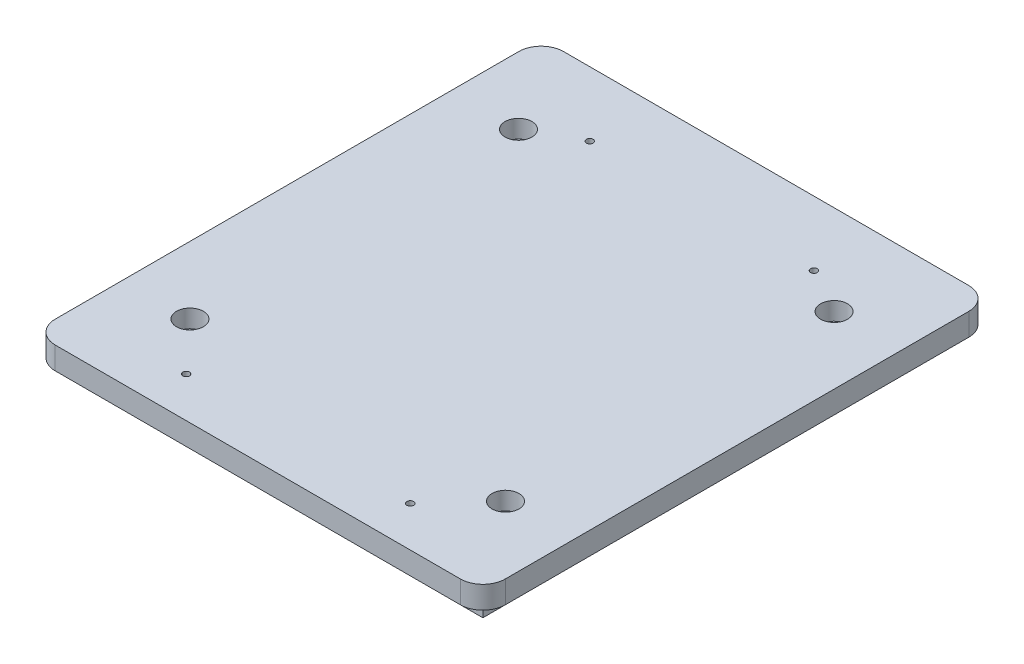
ISO-10303-21;
HEADER;
FILE_DESCRIPTION(('STEP AP214'),'2;1');
FILE_NAME('part.step','',(''),(''),'','','');
FILE_SCHEMA(('AUTOMOTIVE_DESIGN { 1 0 10303 214 1 1 1 1 }'));
ENDSEC;
DATA;
#1=APPLICATION_CONTEXT('core data for automotive mechanical design processes');
#2=APPLICATION_PROTOCOL_DEFINITION('international standard','automotive_design',2000,#1);
#3=PRODUCT_CONTEXT('',#1,'mechanical');
#4=PRODUCT('Part','Part','',(#3));
#5=PRODUCT_RELATED_PRODUCT_CATEGORY('part','',(#4));
#6=PRODUCT_DEFINITION_FORMATION('','',#4);
#7=PRODUCT_DEFINITION_CONTEXT('part definition',#1,'design');
#8=PRODUCT_DEFINITION('design','',#6,#7);
#9=PRODUCT_DEFINITION_SHAPE('','',#8);
#10=(LENGTH_UNIT() NAMED_UNIT(*) SI_UNIT(.MILLI.,.METRE.));
#11=(NAMED_UNIT(*) PLANE_ANGLE_UNIT() SI_UNIT($,.RADIAN.));
#12=(NAMED_UNIT(*) SI_UNIT($,.STERADIAN.) SOLID_ANGLE_UNIT());
#13=UNCERTAINTY_MEASURE_WITH_UNIT(LENGTH_MEASURE(1.E-05),#10,'distance_accuracy_value','');
#14=(GEOMETRIC_REPRESENTATION_CONTEXT(3) GLOBAL_UNCERTAINTY_ASSIGNED_CONTEXT((#13)) GLOBAL_UNIT_ASSIGNED_CONTEXT((#10,
#11,#12)) REPRESENTATION_CONTEXT('',''));
#15=CARTESIAN_POINT('',(0.,0.,0.));
#16=DIRECTION('',(0.,0.,1.));
#17=DIRECTION('',(1.,0.,0.));
#18=AXIS2_PLACEMENT_3D('',#15,#16,#17);
#19=CARTESIAN_POINT('',(-35.2,-12.,-36.65));
#20=DIRECTION('',(0.,1.,0.));
#21=DIRECTION('',(0.,0.,1.));
#22=AXIS2_PLACEMENT_3D('',#19,#20,#21);
#23=CYLINDRICAL_SURFACE('',#22,1.5);
#24=CARTESIAN_POINT('',(-35.2,-5.,-36.65));
#25=DIRECTION('',(0.,1.,0.));
#26=DIRECTION('',(0.,0.,1.));
#27=AXIS2_PLACEMENT_3D('',#24,#25,#26);
#28=CIRCLE('',#27,1.5);
#29=CARTESIAN_POINT('',(-35.2,-5.,-35.15));
#30=VERTEX_POINT('',#29);
#31=EDGE_CURVE('E208',#30,#30,#28,.T.);
#32=ORIENTED_EDGE('',*,*,#31,.F.);
#33=EDGE_LOOP('',(#32));
#34=FACE_BOUND('',#33,.T.);
#35=CARTESIAN_POINT('',(-35.2,1.,-36.65));
#36=DIRECTION('',(0.,1.,0.));
#37=DIRECTION('',(0.,0.,1.));
#38=AXIS2_PLACEMENT_3D('',#35,#36,#37);
#39=CIRCLE('',#38,1.5);
#40=CARTESIAN_POINT('',(-35.2,1.,-35.15));
#41=VERTEX_POINT('',#40);
#42=EDGE_CURVE('E212',#41,#41,#39,.F.);
#43=ORIENTED_EDGE('',*,*,#42,.F.);
#44=EDGE_LOOP('',(#43));
#45=FACE_BOUND('',#44,.T.);
#46=ADVANCED_FACE('F34',(#34,#45),#23,.F.);
#47=CARTESIAN_POINT('',(35.2,-12.,36.65));
#48=DIRECTION('',(0.,1.,0.));
#49=DIRECTION('',(0.,0.,1.));
#50=AXIS2_PLACEMENT_3D('',#47,#48,#49);
#51=CYLINDRICAL_SURFACE('',#50,1.5);
#52=CARTESIAN_POINT('',(35.2,-5.,36.65));
#53=DIRECTION('',(0.,1.,0.));
#54=DIRECTION('',(0.,0.,1.));
#55=AXIS2_PLACEMENT_3D('',#52,#53,#54);
#56=CIRCLE('',#55,1.5);
#57=CARTESIAN_POINT('',(35.2,-5.,38.15));
#58=VERTEX_POINT('',#57);
#59=EDGE_CURVE('E211',#58,#58,#56,.T.);
#60=ORIENTED_EDGE('',*,*,#59,.F.);
#61=EDGE_LOOP('',(#60));
#62=FACE_BOUND('',#61,.T.);
#63=CARTESIAN_POINT('',(35.2,1.,36.65));
#64=DIRECTION('',(0.,1.,0.));
#65=DIRECTION('',(0.,0.,1.));
#66=AXIS2_PLACEMENT_3D('',#63,#64,#65);
#67=CIRCLE('',#66,1.5);
#68=CARTESIAN_POINT('',(35.2,1.,38.15));
#69=VERTEX_POINT('',#68);
#70=EDGE_CURVE('E228',#69,#69,#67,.F.);
#71=ORIENTED_EDGE('',*,*,#70,.F.);
#72=EDGE_LOOP('',(#71));
#73=FACE_BOUND('',#72,.T.);
#74=ADVANCED_FACE('F338',(#62,#73),#51,.F.);
#75=CARTESIAN_POINT('',(35.2,-12.,-36.65));
#76=DIRECTION('',(0.,1.,0.));
#77=DIRECTION('',(0.,0.,1.));
#78=AXIS2_PLACEMENT_3D('',#75,#76,#77);
#79=CYLINDRICAL_SURFACE('',#78,1.5);
#80=CARTESIAN_POINT('',(35.2,-5.,-36.65));
#81=DIRECTION('',(0.,1.,0.));
#82=DIRECTION('',(0.,0.,1.));
#83=AXIS2_PLACEMENT_3D('',#80,#81,#82);
#84=CIRCLE('',#83,1.5);
#85=CARTESIAN_POINT('',(35.2,-5.,-35.15));
#86=VERTEX_POINT('',#85);
#87=EDGE_CURVE('E215',#86,#86,#84,.T.);
#88=ORIENTED_EDGE('',*,*,#87,.F.);
#89=EDGE_LOOP('',(#88));
#90=FACE_BOUND('',#89,.T.);
#91=CARTESIAN_POINT('',(35.2,1.,-36.65));
#92=DIRECTION('',(0.,1.,0.));
#93=DIRECTION('',(0.,0.,1.));
#94=AXIS2_PLACEMENT_3D('',#91,#92,#93);
#95=CIRCLE('',#94,1.5);
#96=CARTESIAN_POINT('',(35.2,1.,-35.15));
#97=VERTEX_POINT('',#96);
#98=EDGE_CURVE('E224',#97,#97,#95,.F.);
#99=ORIENTED_EDGE('',*,*,#98,.F.);
#100=EDGE_LOOP('',(#99));
#101=FACE_BOUND('',#100,.T.);
#102=ADVANCED_FACE('F345',(#90,#101),#79,.F.);
#103=CARTESIAN_POINT('',(-35.2,-12.,36.65));
#104=DIRECTION('',(0.,1.,0.));
#105=DIRECTION('',(0.,0.,1.));
#106=AXIS2_PLACEMENT_3D('',#103,#104,#105);
#107=CYLINDRICAL_SURFACE('',#106,1.5);
#108=CARTESIAN_POINT('',(-35.2,-5.,36.65));
#109=DIRECTION('',(0.,1.,0.));
#110=DIRECTION('',(0.,0.,1.));
#111=AXIS2_PLACEMENT_3D('',#108,#109,#110);
#112=CIRCLE('',#111,1.5);
#113=CARTESIAN_POINT('',(-35.2,-5.,38.15));
#114=VERTEX_POINT('',#113);
#115=EDGE_CURVE('E218',#114,#114,#112,.T.);
#116=ORIENTED_EDGE('',*,*,#115,.F.);
#117=EDGE_LOOP('',(#116));
#118=FACE_BOUND('',#117,.T.);
#119=CARTESIAN_POINT('',(-35.2,1.,36.65));
#120=DIRECTION('',(0.,1.,0.));
#121=DIRECTION('',(0.,0.,1.));
#122=AXIS2_PLACEMENT_3D('',#119,#120,#121);
#123=CIRCLE('',#122,1.5);
#124=CARTESIAN_POINT('',(-35.2,1.,38.15));
#125=VERTEX_POINT('',#124);
#126=EDGE_CURVE('E221',#125,#125,#123,.F.);
#127=ORIENTED_EDGE('',*,*,#126,.F.);
#128=EDGE_LOOP('',(#127));
#129=FACE_BOUND('',#128,.T.);
#130=ADVANCED_FACE('F370',(#118,#129),#107,.F.);
#131=CARTESIAN_POINT('',(50.2,5.,56.7));
#132=DIRECTION('',(-1.,0.,0.));
#133=DIRECTION('',(0.,0.,1.));
#134=AXIS2_PLACEMENT_3D('',#131,#132,#133);
#135=PLANE('',#134);
#136=DIRECTION('',(0.,0.,-1.));
#137=VECTOR('',#136,1.);
#138=CARTESIAN_POINT('',(50.2,0.,56.7));
#139=LINE('',#138,#137);
#140=CARTESIAN_POINT('',(50.2,0.,51.7));
#141=VERTEX_POINT('',#140);
#142=CARTESIAN_POINT('',(50.2,0.,-51.7));
#143=VERTEX_POINT('',#142);
#144=EDGE_CURVE('E150',#141,#143,#139,.T.);
#145=ORIENTED_EDGE('',*,*,#144,.T.);
#146=DIRECTION('',(0.,-1.,0.));
#147=VECTOR('',#146,1.);
#148=CARTESIAN_POINT('',(50.2,5.,-51.7));
#149=LINE('',#148,#147);
#150=CARTESIAN_POINT('',(50.2,5.,-51.7));
#151=VERTEX_POINT('',#150);
#152=EDGE_CURVE('E204',#143,#151,#149,.F.);
#153=ORIENTED_EDGE('',*,*,#152,.T.);
#154=DIRECTION('',(0.,0.,-1.));
#155=VECTOR('',#154,1.);
#156=CARTESIAN_POINT('',(50.2,5.,56.7));
#157=LINE('',#156,#155);
#158=CARTESIAN_POINT('',(50.2,5.,51.7));
#159=VERTEX_POINT('',#158);
#160=EDGE_CURVE('E159',#159,#151,#157,.T.);
#161=ORIENTED_EDGE('',*,*,#160,.F.);
#162=DIRECTION('',(0.,-1.,0.));
#163=VECTOR('',#162,1.);
#164=CARTESIAN_POINT('',(50.2,5.,51.7));
#165=LINE('',#164,#163);
#166=EDGE_CURVE('E201',#159,#141,#165,.T.);
#167=ORIENTED_EDGE('',*,*,#166,.T.);
#168=EDGE_LOOP('',(#145,#153,#161,#167));
#169=FACE_BOUND('',#168,.T.);
#170=ADVANCED_FACE('F314',(#169),#135,.F.);
#171=CARTESIAN_POINT('',(-50.2,5.,-56.7));
#172=DIRECTION('',(0.,0.,1.));
#173=DIRECTION('',(1.,0.,0.));
#174=AXIS2_PLACEMENT_3D('',#171,#172,#173);
#175=PLANE('',#174);
#176=DIRECTION('',(-1.,0.,0.));
#177=VECTOR('',#176,1.);
#178=CARTESIAN_POINT('',(-50.2,0.,-56.7));
#179=LINE('',#178,#177);
#180=CARTESIAN_POINT('',(45.2,0.,-56.7));
#181=VERTEX_POINT('',#180);
#182=CARTESIAN_POINT('',(-45.2,0.,-56.7));
#183=VERTEX_POINT('',#182);
#184=EDGE_CURVE('E153',#181,#183,#179,.T.);
#185=ORIENTED_EDGE('',*,*,#184,.T.);
#186=DIRECTION('',(0.,-1.,0.));
#187=VECTOR('',#186,1.);
#188=CARTESIAN_POINT('',(-45.2,5.,-56.7));
#189=LINE('',#188,#187);
#190=CARTESIAN_POINT('',(-45.2,5.,-56.7));
#191=VERTEX_POINT('',#190);
#192=EDGE_CURVE('E192',#183,#191,#189,.F.);
#193=ORIENTED_EDGE('',*,*,#192,.T.);
#194=DIRECTION('',(-1.,0.,0.));
#195=VECTOR('',#194,1.);
#196=CARTESIAN_POINT('',(-50.2,5.,-56.7));
#197=LINE('',#196,#195);
#198=CARTESIAN_POINT('',(45.2,5.,-56.7));
#199=VERTEX_POINT('',#198);
#200=EDGE_CURVE('E162',#199,#191,#197,.T.);
#201=ORIENTED_EDGE('',*,*,#200,.F.);
#202=DIRECTION('',(0.,-1.,0.));
#203=VECTOR('',#202,1.);
#204=CARTESIAN_POINT('',(45.2,5.,-56.7));
#205=LINE('',#204,#203);
#206=EDGE_CURVE('E189',#199,#181,#205,.T.);
#207=ORIENTED_EDGE('',*,*,#206,.T.);
#208=EDGE_LOOP('',(#185,#193,#201,#207));
#209=FACE_BOUND('',#208,.T.);
#210=ADVANCED_FACE('F322',(#209),#175,.F.);
#211=CARTESIAN_POINT('',(-50.2,5.,56.7));
#212=DIRECTION('',(1.,0.,0.));
#213=DIRECTION('',(0.,0.,-1.));
#214=AXIS2_PLACEMENT_3D('',#211,#212,#213);
#215=PLANE('',#214);
#216=DIRECTION('',(0.,0.,1.));
#217=VECTOR('',#216,1.);
#218=CARTESIAN_POINT('',(-50.2,5.,56.7));
#219=LINE('',#218,#217);
#220=CARTESIAN_POINT('',(-50.2,5.,-51.7));
#221=VERTEX_POINT('',#220);
#222=CARTESIAN_POINT('',(-50.2,5.,51.7));
#223=VERTEX_POINT('',#222);
#224=EDGE_CURVE('E166',#221,#223,#219,.T.);
#225=ORIENTED_EDGE('',*,*,#224,.F.);
#226=DIRECTION('',(0.,-1.,0.));
#227=VECTOR('',#226,1.);
#228=CARTESIAN_POINT('',(-50.2,5.,-51.7));
#229=LINE('',#228,#227);
#230=CARTESIAN_POINT('',(-50.2,0.,-51.7));
#231=VERTEX_POINT('',#230);
#232=EDGE_CURVE('E178',#221,#231,#229,.T.);
#233=ORIENTED_EDGE('',*,*,#232,.T.);
#234=DIRECTION('',(0.,0.,1.));
#235=VECTOR('',#234,1.);
#236=CARTESIAN_POINT('',(-50.2,0.,56.7));
#237=LINE('',#236,#235);
#238=CARTESIAN_POINT('',(-50.2,0.,51.7));
#239=VERTEX_POINT('',#238);
#240=EDGE_CURVE('E173',#231,#239,#237,.T.);
#241=ORIENTED_EDGE('',*,*,#240,.T.);
#242=DIRECTION('',(0.,-1.,0.));
#243=VECTOR('',#242,1.);
#244=CARTESIAN_POINT('',(-50.2,5.,51.7));
#245=LINE('',#244,#243);
#246=EDGE_CURVE('E169',#239,#223,#245,.F.);
#247=ORIENTED_EDGE('',*,*,#246,.T.);
#248=EDGE_LOOP('',(#225,#233,#241,#247));
#249=FACE_BOUND('',#248,.T.);
#250=ADVANCED_FACE('F302',(#249),#215,.F.);
#251=CARTESIAN_POINT('',(-50.2,5.,56.7));
#252=DIRECTION('',(0.,0.,-1.));
#253=DIRECTION('',(-1.,0.,0.));
#254=AXIS2_PLACEMENT_3D('',#251,#252,#253);
#255=PLANE('',#254);
#256=DIRECTION('',(1.,0.,0.));
#257=VECTOR('',#256,1.);
#258=CARTESIAN_POINT('',(-50.2,0.,56.7));
#259=LINE('',#258,#257);
#260=CARTESIAN_POINT('',(-45.2,0.,56.7));
#261=VERTEX_POINT('',#260);
#262=CARTESIAN_POINT('',(45.2,0.,56.7));
#263=VERTEX_POINT('',#262);
#264=EDGE_CURVE('E163',#261,#263,#259,.T.);
#265=ORIENTED_EDGE('',*,*,#264,.T.);
#266=DIRECTION('',(0.,-1.,0.));
#267=VECTOR('',#266,1.);
#268=CARTESIAN_POINT('',(45.2,5.,56.7));
#269=LINE('',#268,#267);
#270=CARTESIAN_POINT('',(45.2,5.,56.7));
#271=VERTEX_POINT('',#270);
#272=EDGE_CURVE('E11',#263,#271,#269,.F.);
#273=ORIENTED_EDGE('',*,*,#272,.T.);
#274=DIRECTION('',(1.,0.,0.));
#275=VECTOR('',#274,1.);
#276=CARTESIAN_POINT('',(-50.2,5.,56.7));
#277=LINE('',#276,#275);
#278=CARTESIAN_POINT('',(-45.2,5.,56.7));
#279=VERTEX_POINT('',#278);
#280=EDGE_CURVE('E168',#279,#271,#277,.T.);
#281=ORIENTED_EDGE('',*,*,#280,.F.);
#282=DIRECTION('',(0.,-1.,0.));
#283=VECTOR('',#282,1.);
#284=CARTESIAN_POINT('',(-45.2,5.,56.7));
#285=LINE('',#284,#283);
#286=EDGE_CURVE('E43',#279,#261,#285,.T.);
#287=ORIENTED_EDGE('',*,*,#286,.T.);
#288=EDGE_LOOP('',(#265,#273,#281,#287));
#289=FACE_BOUND('',#288,.T.);
#290=ADVANCED_FACE('F306',(#289),#255,.F.);
#291=CARTESIAN_POINT('',(0.,5.,0.));
#292=DIRECTION('',(0.,-1.,0.));
#293=DIRECTION('',(0.,0.,-1.));
#294=AXIS2_PLACEMENT_3D('',#291,#292,#293);
#295=PLANE('',#294);
#296=CARTESIAN_POINT('',(-25.,5.,47.7));
#297=DIRECTION('',(0.,1.,0.));
#298=DIRECTION('',(0.,0.,1.));
#299=AXIS2_PLACEMENT_3D('',#296,#297,#298);
#300=CIRCLE('',#299,0.750000000000002);
#301=CARTESIAN_POINT('',(-25.,5.,48.45));
#302=VERTEX_POINT('',#301);
#303=EDGE_CURVE('E456',#302,#302,#300,.T.);
#304=ORIENTED_EDGE('',*,*,#303,.F.);
#305=EDGE_LOOP('',(#304));
#306=FACE_BOUND('',#305,.T.);
#307=CARTESIAN_POINT('',(25.054333875246,5.,-42.2999835990541));
#308=DIRECTION('',(0.,1.,0.));
#309=DIRECTION('',(0.,0.,1.));
#310=AXIS2_PLACEMENT_3D('',#307,#308,#309);
#311=CIRCLE('',#310,0.750000000002579);
#312=CARTESIAN_POINT('',(25.054333875246,5.,-41.5499835990515));
#313=VERTEX_POINT('',#312);
#314=EDGE_CURVE('E453',#313,#313,#311,.T.);
#315=ORIENTED_EDGE('',*,*,#314,.F.);
#316=EDGE_LOOP('',(#315));
#317=FACE_BOUND('',#316,.T.);
#318=CARTESIAN_POINT('',(25.,5.,47.7));
#319=DIRECTION('',(0.,1.,0.));
#320=DIRECTION('',(0.,0.,1.));
#321=AXIS2_PLACEMENT_3D('',#318,#319,#320);
#322=CIRCLE('',#321,0.750000000000002);
#323=CARTESIAN_POINT('',(25.,5.,48.45));
#324=VERTEX_POINT('',#323);
#325=EDGE_CURVE('E434',#324,#324,#322,.T.);
#326=ORIENTED_EDGE('',*,*,#325,.F.);
#327=EDGE_LOOP('',(#326));
#328=FACE_BOUND('',#327,.T.);
#329=CARTESIAN_POINT('',(-24.945666124754,5.,-42.2999835990541));
#330=DIRECTION('',(0.,1.,0.));
#331=DIRECTION('',(0.,0.,1.));
#332=AXIS2_PLACEMENT_3D('',#329,#330,#331);
#333=CIRCLE('',#332,0.750000000000002);
#334=CARTESIAN_POINT('',(-24.945666124754,5.,-41.5499835990541));
#335=VERTEX_POINT('',#334);
#336=EDGE_CURVE('E237',#335,#335,#333,.T.);
#337=ORIENTED_EDGE('',*,*,#336,.F.);
#338=EDGE_LOOP('',(#337));
#339=FACE_BOUND('',#338,.T.);
#340=CARTESIAN_POINT('',(-35.2,5.,36.65));
#341=DIRECTION('',(0.,1.,0.));
#342=DIRECTION('',(0.,0.,1.));
#343=AXIS2_PLACEMENT_3D('',#340,#341,#342);
#344=CIRCLE('',#343,3.);
#345=CARTESIAN_POINT('',(-35.2,5.,39.65));
#346=VERTEX_POINT('',#345);
#347=EDGE_CURVE('E261',#346,#346,#344,.T.);
#348=ORIENTED_EDGE('',*,*,#347,.F.);
#349=EDGE_LOOP('',(#348));
#350=FACE_BOUND('',#349,.T.);
#351=CARTESIAN_POINT('',(35.2,5.,-36.65));
#352=DIRECTION('',(0.,1.,0.));
#353=DIRECTION('',(0.,0.,1.));
#354=AXIS2_PLACEMENT_3D('',#351,#352,#353);
#355=CIRCLE('',#354,3.);
#356=CARTESIAN_POINT('',(35.2,5.,-33.65));
#357=VERTEX_POINT('',#356);
#358=EDGE_CURVE('E253',#357,#357,#355,.T.);
#359=ORIENTED_EDGE('',*,*,#358,.F.);
#360=EDGE_LOOP('',(#359));
#361=FACE_BOUND('',#360,.T.);
#362=CARTESIAN_POINT('',(35.2,5.,36.65));
#363=DIRECTION('',(0.,1.,0.));
#364=DIRECTION('',(0.,0.,1.));
#365=AXIS2_PLACEMENT_3D('',#362,#363,#364);
#366=CIRCLE('',#365,3.);
#367=CARTESIAN_POINT('',(35.2,5.,39.65));
#368=VERTEX_POINT('',#367);
#369=EDGE_CURVE('E244',#368,#368,#366,.T.);
#370=ORIENTED_EDGE('',*,*,#369,.F.);
#371=EDGE_LOOP('',(#370));
#372=FACE_BOUND('',#371,.T.);
#373=CARTESIAN_POINT('',(-35.2,5.,-36.65));
#374=DIRECTION('',(0.,1.,0.));
#375=DIRECTION('',(0.,0.,1.));
#376=AXIS2_PLACEMENT_3D('',#373,#374,#375);
#377=CIRCLE('',#376,3.);
#378=CARTESIAN_POINT('',(-35.2,5.,-33.65));
#379=VERTEX_POINT('',#378);
#380=EDGE_CURVE('E260',#379,#379,#377,.T.);
#381=ORIENTED_EDGE('',*,*,#380,.F.);
#382=EDGE_LOOP('',(#381));
#383=FACE_BOUND('',#382,.T.);
#384=ORIENTED_EDGE('',*,*,#200,.T.);
#385=CARTESIAN_POINT('',(-45.2,5.,-51.7));
#386=DIRECTION('',(0.,-1.,0.));
#387=DIRECTION('',(0.,0.,-1.));
#388=AXIS2_PLACEMENT_3D('',#385,#386,#387);
#389=CIRCLE('',#388,5.);
#390=EDGE_CURVE('E199',#191,#221,#389,.F.);
#391=ORIENTED_EDGE('',*,*,#390,.T.);
#392=ORIENTED_EDGE('',*,*,#224,.T.);
#393=CARTESIAN_POINT('',(-45.2,5.,51.7));
#394=DIRECTION('',(0.,-1.,0.));
#395=DIRECTION('',(0.,0.,-1.));
#396=AXIS2_PLACEMENT_3D('',#393,#394,#395);
#397=CIRCLE('',#396,5.);
#398=EDGE_CURVE('E56',#223,#279,#397,.F.);
#399=ORIENTED_EDGE('',*,*,#398,.T.);
#400=ORIENTED_EDGE('',*,*,#280,.T.);
#401=CARTESIAN_POINT('',(45.2,5.,51.7));
#402=DIRECTION('',(0.,-1.,0.));
#403=DIRECTION('',(0.,0.,-1.));
#404=AXIS2_PLACEMENT_3D('',#401,#402,#403);
#405=CIRCLE('',#404,5.);
#406=EDGE_CURVE('E195',#271,#159,#405,.F.);
#407=ORIENTED_EDGE('',*,*,#406,.T.);
#408=ORIENTED_EDGE('',*,*,#160,.T.);
#409=CARTESIAN_POINT('',(45.2,5.,-51.7));
#410=DIRECTION('',(0.,-1.,0.));
#411=DIRECTION('',(0.,0.,-1.));
#412=AXIS2_PLACEMENT_3D('',#409,#410,#411);
#413=CIRCLE('',#412,5.);
#414=EDGE_CURVE('E197',#151,#199,#413,.F.);
#415=ORIENTED_EDGE('',*,*,#414,.T.);
#416=EDGE_LOOP('',(#384,#391,#392,#399,#400,#407,#408,#415));
#417=FACE_BOUND('',#416,.T.);
#418=ADVANCED_FACE('F294',(#306,#317,#328,#339,#350,#361,#372,#383,#417),#295,.F.);
#419=CARTESIAN_POINT('',(0.,0.,0.));
#420=DIRECTION('',(0.,-1.,0.));
#421=DIRECTION('',(0.,0.,-1.));
#422=AXIS2_PLACEMENT_3D('',#419,#420,#421);
#423=PLANE('',#422);
#424=DIRECTION('',(0.,0.,1.));
#425=VECTOR('',#424,1.);
#426=CARTESIAN_POINT('',(45.2,0.,-51.7));
#427=LINE('',#426,#425);
#428=CARTESIAN_POINT('',(45.2,0.,-51.7));
#429=VERTEX_POINT('',#428);
#430=CARTESIAN_POINT('',(45.2,0.,51.7));
#431=VERTEX_POINT('',#430);
#432=EDGE_CURVE('E149',#429,#431,#427,.T.);
#433=ORIENTED_EDGE('',*,*,#432,.F.);
#434=DIRECTION('',(1.,0.,0.));
#435=VECTOR('',#434,1.);
#436=CARTESIAN_POINT('',(-45.2,0.,-51.7));
#437=LINE('',#436,#435);
#438=CARTESIAN_POINT('',(-45.2,0.,-51.7));
#439=VERTEX_POINT('',#438);
#440=EDGE_CURVE('E146',#439,#429,#437,.T.);
#441=ORIENTED_EDGE('',*,*,#440,.F.);
#442=DIRECTION('',(0.,0.,-1.));
#443=VECTOR('',#442,1.);
#444=CARTESIAN_POINT('',(-45.2,0.,-51.7));
#445=LINE('',#444,#443);
#446=CARTESIAN_POINT('',(-45.2,0.,51.7));
#447=VERTEX_POINT('',#446);
#448=EDGE_CURVE('E279',#447,#439,#445,.T.);
#449=ORIENTED_EDGE('',*,*,#448,.F.);
#450=DIRECTION('',(-1.,0.,0.));
#451=VECTOR('',#450,1.);
#452=CARTESIAN_POINT('',(-45.2,0.,51.7));
#453=LINE('',#452,#451);
#454=EDGE_CURVE('E277',#431,#447,#453,.T.);
#455=ORIENTED_EDGE('',*,*,#454,.F.);
#456=EDGE_LOOP('',(#433,#441,#449,#455));
#457=FACE_BOUND('',#456,.T.);
#458=ORIENTED_EDGE('',*,*,#240,.F.);
#459=CARTESIAN_POINT('',(-45.2,0.,-51.7));
#460=DIRECTION('',(0.,-1.,0.));
#461=DIRECTION('',(0.,0.,-1.));
#462=AXIS2_PLACEMENT_3D('',#459,#460,#461);
#463=CIRCLE('',#462,5.);
#464=EDGE_CURVE('E187',#231,#183,#463,.T.);
#465=ORIENTED_EDGE('',*,*,#464,.T.);
#466=ORIENTED_EDGE('',*,*,#184,.F.);
#467=CARTESIAN_POINT('',(45.2,0.,-51.7));
#468=DIRECTION('',(0.,-1.,0.));
#469=DIRECTION('',(0.,0.,-1.));
#470=AXIS2_PLACEMENT_3D('',#467,#468,#469);
#471=CIRCLE('',#470,5.);
#472=EDGE_CURVE('E185',#181,#143,#471,.T.);
#473=ORIENTED_EDGE('',*,*,#472,.T.);
#474=ORIENTED_EDGE('',*,*,#144,.F.);
#475=CARTESIAN_POINT('',(45.2,0.,51.7));
#476=DIRECTION('',(0.,-1.,0.));
#477=DIRECTION('',(0.,0.,-1.));
#478=AXIS2_PLACEMENT_3D('',#475,#476,#477);
#479=CIRCLE('',#478,5.);
#480=EDGE_CURVE('E183',#141,#263,#479,.T.);
#481=ORIENTED_EDGE('',*,*,#480,.T.);
#482=ORIENTED_EDGE('',*,*,#264,.F.);
#483=CARTESIAN_POINT('',(-45.2,0.,51.7));
#484=DIRECTION('',(0.,-1.,0.));
#485=DIRECTION('',(0.,0.,-1.));
#486=AXIS2_PLACEMENT_3D('',#483,#484,#485);
#487=CIRCLE('',#486,5.);
#488=EDGE_CURVE('E181',#261,#239,#487,.T.);
#489=ORIENTED_EDGE('',*,*,#488,.T.);
#490=EDGE_LOOP('',(#458,#465,#466,#473,#474,#481,#482,#489));
#491=FACE_BOUND('',#490,.T.);
#492=ADVANCED_FACE('F291',(#457,#491),#423,.T.);
#493=CARTESIAN_POINT('',(45.2,-5.,-51.7));
#494=DIRECTION('',(-1.,0.,0.));
#495=DIRECTION('',(0.,0.,1.));
#496=AXIS2_PLACEMENT_3D('',#493,#494,#495);
#497=PLANE('',#496);
#498=ORIENTED_EDGE('',*,*,#432,.T.);
#499=DIRECTION('',(0.,1.,0.));
#500=VECTOR('',#499,1.);
#501=CARTESIAN_POINT('',(45.2,-5.,51.7));
#502=LINE('',#501,#500);
#503=CARTESIAN_POINT('',(45.2,-5.,51.7));
#504=VERTEX_POINT('',#503);
#505=EDGE_CURVE('E130',#504,#431,#502,.T.);
#506=ORIENTED_EDGE('',*,*,#505,.F.);
#507=DIRECTION('',(0.,0.,1.));
#508=VECTOR('',#507,1.);
#509=CARTESIAN_POINT('',(45.2,-5.,-51.7));
#510=LINE('',#509,#508);
#511=CARTESIAN_POINT('',(45.2,-5.,-51.7));
#512=VERTEX_POINT('',#511);
#513=EDGE_CURVE('E137',#512,#504,#510,.T.);
#514=ORIENTED_EDGE('',*,*,#513,.F.);
#515=DIRECTION('',(0.,1.,0.));
#516=VECTOR('',#515,1.);
#517=CARTESIAN_POINT('',(45.2,-5.,-51.7));
#518=LINE('',#517,#516);
#519=EDGE_CURVE('E275',#512,#429,#518,.T.);
#520=ORIENTED_EDGE('',*,*,#519,.T.);
#521=EDGE_LOOP('',(#498,#506,#514,#520));
#522=FACE_BOUND('',#521,.T.);
#523=ADVANCED_FACE('F148',(#522),#497,.F.);
#524=CARTESIAN_POINT('',(-45.2,-5.,51.7));
#525=DIRECTION('',(0.,0.,-1.));
#526=DIRECTION('',(-1.,0.,0.));
#527=AXIS2_PLACEMENT_3D('',#524,#525,#526);
#528=PLANE('',#527);
#529=ORIENTED_EDGE('',*,*,#454,.T.);
#530=DIRECTION('',(0.,1.,0.));
#531=VECTOR('',#530,1.);
#532=CARTESIAN_POINT('',(-45.2,-5.,51.7));
#533=LINE('',#532,#531);
#534=CARTESIAN_POINT('',(-45.2,-5.,51.7));
#535=VERTEX_POINT('',#534);
#536=EDGE_CURVE('E133',#535,#447,#533,.T.);
#537=ORIENTED_EDGE('',*,*,#536,.F.);
#538=DIRECTION('',(-1.,0.,0.));
#539=VECTOR('',#538,1.);
#540=CARTESIAN_POINT('',(-45.2,-5.,51.7));
#541=LINE('',#540,#539);
#542=EDGE_CURVE('E125',#504,#535,#541,.T.);
#543=ORIENTED_EDGE('',*,*,#542,.F.);
#544=ORIENTED_EDGE('',*,*,#505,.T.);
#545=EDGE_LOOP('',(#529,#537,#543,#544));
#546=FACE_BOUND('',#545,.T.);
#547=ADVANCED_FACE('F128',(#546),#528,.F.);
#548=CARTESIAN_POINT('',(-45.2,-5.,-51.7));
#549=DIRECTION('',(1.,0.,0.));
#550=DIRECTION('',(0.,0.,-1.));
#551=AXIS2_PLACEMENT_3D('',#548,#549,#550);
#552=PLANE('',#551);
#553=ORIENTED_EDGE('',*,*,#448,.T.);
#554=DIRECTION('',(0.,1.,0.));
#555=VECTOR('',#554,1.);
#556=CARTESIAN_POINT('',(-45.2,-5.,-51.7));
#557=LINE('',#556,#555);
#558=CARTESIAN_POINT('',(-45.2,-5.,-51.7));
#559=VERTEX_POINT('',#558);
#560=EDGE_CURVE('E155',#559,#439,#557,.T.);
#561=ORIENTED_EDGE('',*,*,#560,.F.);
#562=DIRECTION('',(0.,0.,-1.));
#563=VECTOR('',#562,1.);
#564=CARTESIAN_POINT('',(-45.2,-5.,-51.7));
#565=LINE('',#564,#563);
#566=EDGE_CURVE('E136',#535,#559,#565,.T.);
#567=ORIENTED_EDGE('',*,*,#566,.F.);
#568=ORIENTED_EDGE('',*,*,#536,.T.);
#569=EDGE_LOOP('',(#553,#561,#567,#568));
#570=FACE_BOUND('',#569,.T.);
#571=ADVANCED_FACE('F289',(#570),#552,.F.);
#572=CARTESIAN_POINT('',(-45.2,-5.,-51.7));
#573=DIRECTION('',(0.,0.,1.));
#574=DIRECTION('',(1.,0.,0.));
#575=AXIS2_PLACEMENT_3D('',#572,#573,#574);
#576=PLANE('',#575);
#577=ORIENTED_EDGE('',*,*,#440,.T.);
#578=ORIENTED_EDGE('',*,*,#519,.F.);
#579=DIRECTION('',(1.,0.,0.));
#580=VECTOR('',#579,1.);
#581=CARTESIAN_POINT('',(-45.2,-5.,-51.7));
#582=LINE('',#581,#580);
#583=EDGE_CURVE('E142',#559,#512,#582,.T.);
#584=ORIENTED_EDGE('',*,*,#583,.F.);
#585=ORIENTED_EDGE('',*,*,#560,.T.);
#586=EDGE_LOOP('',(#577,#578,#584,#585));
#587=FACE_BOUND('',#586,.T.);
#588=ADVANCED_FACE('F287',(#587),#576,.F.);
#589=CARTESIAN_POINT('',(0.,-5.,0.));
#590=DIRECTION('',(0.,1.,0.));
#591=DIRECTION('',(0.,0.,1.));
#592=AXIS2_PLACEMENT_3D('',#589,#590,#591);
#593=PLANE('',#592);
#594=CARTESIAN_POINT('',(-25.,-5.,47.7));
#595=DIRECTION('',(0.,1.,0.));
#596=DIRECTION('',(0.,0.,1.));
#597=AXIS2_PLACEMENT_3D('',#594,#595,#596);
#598=CIRCLE('',#597,0.750000000000002);
#599=CARTESIAN_POINT('',(-25.,-5.,48.45));
#600=VERTEX_POINT('',#599);
#601=EDGE_CURVE('E38',#600,#600,#598,.T.);
#602=ORIENTED_EDGE('',*,*,#601,.T.);
#603=EDGE_LOOP('',(#602));
#604=FACE_BOUND('',#603,.T.);
#605=CARTESIAN_POINT('',(25.054333875246,-5.,-42.2999835990541));
#606=DIRECTION('',(0.,1.,0.));
#607=DIRECTION('',(0.,0.,1.));
#608=AXIS2_PLACEMENT_3D('',#605,#606,#607);
#609=CIRCLE('',#608,0.750000000002579);
#610=CARTESIAN_POINT('',(25.054333875246,-5.,-41.5499835990515));
#611=VERTEX_POINT('',#610);
#612=EDGE_CURVE('E239',#611,#611,#609,.T.);
#613=ORIENTED_EDGE('',*,*,#612,.T.);
#614=EDGE_LOOP('',(#613));
#615=FACE_BOUND('',#614,.T.);
#616=CARTESIAN_POINT('',(25.,-5.,47.7));
#617=DIRECTION('',(0.,1.,0.));
#618=DIRECTION('',(0.,0.,1.));
#619=AXIS2_PLACEMENT_3D('',#616,#617,#618);
#620=CIRCLE('',#619,0.750000000000002);
#621=CARTESIAN_POINT('',(25.,-5.,48.45));
#622=VERTEX_POINT('',#621);
#623=EDGE_CURVE('E236',#622,#622,#620,.T.);
#624=ORIENTED_EDGE('',*,*,#623,.T.);
#625=EDGE_LOOP('',(#624));
#626=FACE_BOUND('',#625,.T.);
#627=CARTESIAN_POINT('',(-24.945666124754,-5.,-42.2999835990541));
#628=DIRECTION('',(0.,1.,0.));
#629=DIRECTION('',(0.,0.,1.));
#630=AXIS2_PLACEMENT_3D('',#627,#628,#629);
#631=CIRCLE('',#630,0.750000000000002);
#632=CARTESIAN_POINT('',(-24.945666124754,-5.,-41.5499835990541));
#633=VERTEX_POINT('',#632);
#634=EDGE_CURVE('E233',#633,#633,#631,.T.);
#635=ORIENTED_EDGE('',*,*,#634,.T.);
#636=EDGE_LOOP('',(#635));
#637=FACE_BOUND('',#636,.T.);
#638=ORIENTED_EDGE('',*,*,#115,.T.);
#639=EDGE_LOOP('',(#638));
#640=FACE_BOUND('',#639,.T.);
#641=ORIENTED_EDGE('',*,*,#87,.T.);
#642=EDGE_LOOP('',(#641));
#643=FACE_BOUND('',#642,.T.);
#644=ORIENTED_EDGE('',*,*,#59,.T.);
#645=EDGE_LOOP('',(#644));
#646=FACE_BOUND('',#645,.T.);
#647=ORIENTED_EDGE('',*,*,#31,.T.);
#648=EDGE_LOOP('',(#647));
#649=FACE_BOUND('',#648,.T.);
#650=ORIENTED_EDGE('',*,*,#513,.T.);
#651=ORIENTED_EDGE('',*,*,#542,.T.);
#652=ORIENTED_EDGE('',*,*,#566,.T.);
#653=ORIENTED_EDGE('',*,*,#583,.T.);
#654=EDGE_LOOP('',(#650,#651,#652,#653));
#655=FACE_BOUND('',#654,.T.);
#656=ADVANCED_FACE('F140',(#604,#615,#626,#637,#640,#643,#646,#649,#655),#593,.F.);
#657=CARTESIAN_POINT('',(-45.2,5.,-51.7));
#658=DIRECTION('',(0.,-1.,0.));
#659=DIRECTION('',(0.,0.,-1.));
#660=AXIS2_PLACEMENT_3D('',#657,#658,#659);
#661=CYLINDRICAL_SURFACE('',#660,5.);
#662=ORIENTED_EDGE('',*,*,#390,.F.);
#663=ORIENTED_EDGE('',*,*,#192,.F.);
#664=ORIENTED_EDGE('',*,*,#464,.F.);
#665=ORIENTED_EDGE('',*,*,#232,.F.);
#666=EDGE_LOOP('',(#662,#663,#664,#665));
#667=FACE_BOUND('',#666,.T.);
#668=ADVANCED_FACE('F326',(#667),#661,.T.);
#669=CARTESIAN_POINT('',(45.2,5.,-51.7));
#670=DIRECTION('',(0.,-1.,0.));
#671=DIRECTION('',(0.,0.,-1.));
#672=AXIS2_PLACEMENT_3D('',#669,#670,#671);
#673=CYLINDRICAL_SURFACE('',#672,5.);
#674=ORIENTED_EDGE('',*,*,#414,.F.);
#675=ORIENTED_EDGE('',*,*,#152,.F.);
#676=ORIENTED_EDGE('',*,*,#472,.F.);
#677=ORIENTED_EDGE('',*,*,#206,.F.);
#678=EDGE_LOOP('',(#674,#675,#676,#677));
#679=FACE_BOUND('',#678,.T.);
#680=ADVANCED_FACE('F320',(#679),#673,.T.);
#681=CARTESIAN_POINT('',(45.2,5.,51.7));
#682=DIRECTION('',(0.,-1.,0.));
#683=DIRECTION('',(0.,0.,-1.));
#684=AXIS2_PLACEMENT_3D('',#681,#682,#683);
#685=CYLINDRICAL_SURFACE('',#684,5.);
#686=ORIENTED_EDGE('',*,*,#406,.F.);
#687=ORIENTED_EDGE('',*,*,#272,.F.);
#688=ORIENTED_EDGE('',*,*,#480,.F.);
#689=ORIENTED_EDGE('',*,*,#166,.F.);
#690=EDGE_LOOP('',(#686,#687,#688,#689));
#691=FACE_BOUND('',#690,.T.);
#692=ADVANCED_FACE('F311',(#691),#685,.T.);
#693=CARTESIAN_POINT('',(-45.2,5.,51.7));
#694=DIRECTION('',(0.,-1.,0.));
#695=DIRECTION('',(0.,0.,-1.));
#696=AXIS2_PLACEMENT_3D('',#693,#694,#695);
#697=CYLINDRICAL_SURFACE('',#696,5.);
#698=ORIENTED_EDGE('',*,*,#398,.F.);
#699=ORIENTED_EDGE('',*,*,#246,.F.);
#700=ORIENTED_EDGE('',*,*,#488,.F.);
#701=ORIENTED_EDGE('',*,*,#286,.F.);
#702=EDGE_LOOP('',(#698,#699,#700,#701));
#703=FACE_BOUND('',#702,.T.);
#704=ADVANCED_FACE('F36',(#703),#697,.T.);
#705=CARTESIAN_POINT('',(-35.2,1.,36.65));
#706=DIRECTION('',(0.,1.,0.));
#707=DIRECTION('',(0.,0.,1.));
#708=AXIS2_PLACEMENT_3D('',#705,#706,#707);
#709=PLANE('',#708);
#710=CARTESIAN_POINT('',(-35.2,1.,36.65));
#711=DIRECTION('',(0.,1.,0.));
#712=DIRECTION('',(0.,0.,1.));
#713=AXIS2_PLACEMENT_3D('',#710,#711,#712);
#714=CIRCLE('',#713,3.);
#715=CARTESIAN_POINT('',(-35.2,1.,39.65));
#716=VERTEX_POINT('',#715);
#717=EDGE_CURVE('E257',#716,#716,#714,.T.);
#718=ORIENTED_EDGE('',*,*,#717,.T.);
#719=EDGE_LOOP('',(#718));
#720=FACE_BOUND('',#719,.T.);
#721=ORIENTED_EDGE('',*,*,#126,.T.);
#722=EDGE_LOOP('',(#721));
#723=FACE_BOUND('',#722,.T.);
#724=ADVANCED_FACE('F405',(#720,#723),#709,.T.);
#725=CARTESIAN_POINT('',(-35.2,1.,36.65));
#726=DIRECTION('',(0.,1.,0.));
#727=DIRECTION('',(0.,0.,1.));
#728=AXIS2_PLACEMENT_3D('',#725,#726,#727);
#729=CYLINDRICAL_SURFACE('',#728,3.);
#730=ORIENTED_EDGE('',*,*,#717,.F.);
#731=EDGE_LOOP('',(#730));
#732=FACE_BOUND('',#731,.T.);
#733=ORIENTED_EDGE('',*,*,#347,.T.);
#734=EDGE_LOOP('',(#733));
#735=FACE_BOUND('',#734,.T.);
#736=ADVANCED_FACE('F401',(#732,#735),#729,.F.);
#737=CARTESIAN_POINT('',(35.2,1.,-36.65));
#738=DIRECTION('',(0.,1.,0.));
#739=DIRECTION('',(0.,0.,1.));
#740=AXIS2_PLACEMENT_3D('',#737,#738,#739);
#741=PLANE('',#740);
#742=CARTESIAN_POINT('',(35.2,1.,-36.65));
#743=DIRECTION('',(0.,1.,0.));
#744=DIRECTION('',(0.,0.,1.));
#745=AXIS2_PLACEMENT_3D('',#742,#743,#744);
#746=CIRCLE('',#745,3.);
#747=CARTESIAN_POINT('',(35.2,1.,-33.65));
#748=VERTEX_POINT('',#747);
#749=EDGE_CURVE('E264',#748,#748,#746,.T.);
#750=ORIENTED_EDGE('',*,*,#749,.T.);
#751=EDGE_LOOP('',(#750));
#752=FACE_BOUND('',#751,.T.);
#753=ORIENTED_EDGE('',*,*,#98,.T.);
#754=EDGE_LOOP('',(#753));
#755=FACE_BOUND('',#754,.T.);
#756=ADVANCED_FACE('F397',(#752,#755),#741,.T.);
#757=CARTESIAN_POINT('',(35.2,1.,-36.65));
#758=DIRECTION('',(0.,1.,0.));
#759=DIRECTION('',(0.,0.,1.));
#760=AXIS2_PLACEMENT_3D('',#757,#758,#759);
#761=CYLINDRICAL_SURFACE('',#760,3.);
#762=ORIENTED_EDGE('',*,*,#749,.F.);
#763=EDGE_LOOP('',(#762));
#764=FACE_BOUND('',#763,.T.);
#765=ORIENTED_EDGE('',*,*,#358,.T.);
#766=EDGE_LOOP('',(#765));
#767=FACE_BOUND('',#766,.T.);
#768=ADVANCED_FACE('F393',(#764,#767),#761,.F.);
#769=CARTESIAN_POINT('',(35.2,1.,36.65));
#770=DIRECTION('',(0.,1.,0.));
#771=DIRECTION('',(0.,0.,1.));
#772=AXIS2_PLACEMENT_3D('',#769,#770,#771);
#773=PLANE('',#772);
#774=CARTESIAN_POINT('',(35.2,1.,36.65));
#775=DIRECTION('',(0.,1.,0.));
#776=DIRECTION('',(0.,0.,1.));
#777=AXIS2_PLACEMENT_3D('',#774,#775,#776);
#778=CIRCLE('',#777,3.);
#779=CARTESIAN_POINT('',(35.2,1.,39.65));
#780=VERTEX_POINT('',#779);
#781=EDGE_CURVE('E248',#780,#780,#778,.T.);
#782=ORIENTED_EDGE('',*,*,#781,.T.);
#783=EDGE_LOOP('',(#782));
#784=FACE_BOUND('',#783,.T.);
#785=ORIENTED_EDGE('',*,*,#70,.T.);
#786=EDGE_LOOP('',(#785));
#787=FACE_BOUND('',#786,.T.);
#788=ADVANCED_FACE('F396',(#784,#787),#773,.T.);
#789=CARTESIAN_POINT('',(35.2,1.,36.65));
#790=DIRECTION('',(0.,1.,0.));
#791=DIRECTION('',(0.,0.,1.));
#792=AXIS2_PLACEMENT_3D('',#789,#790,#791);
#793=CYLINDRICAL_SURFACE('',#792,3.);
#794=ORIENTED_EDGE('',*,*,#781,.F.);
#795=EDGE_LOOP('',(#794));
#796=FACE_BOUND('',#795,.T.);
#797=ORIENTED_EDGE('',*,*,#369,.T.);
#798=EDGE_LOOP('',(#797));
#799=FACE_BOUND('',#798,.T.);
#800=ADVANCED_FACE('F391',(#796,#799),#793,.F.);
#801=CARTESIAN_POINT('',(-35.2,1.,-36.65));
#802=DIRECTION('',(0.,1.,0.));
#803=DIRECTION('',(0.,0.,1.));
#804=AXIS2_PLACEMENT_3D('',#801,#802,#803);
#805=PLANE('',#804);
#806=CARTESIAN_POINT('',(-35.2,1.,-36.65));
#807=DIRECTION('',(0.,1.,0.));
#808=DIRECTION('',(0.,0.,1.));
#809=AXIS2_PLACEMENT_3D('',#806,#807,#808);
#810=CIRCLE('',#809,3.);
#811=CARTESIAN_POINT('',(-35.2,1.,-33.65));
#812=VERTEX_POINT('',#811);
#813=EDGE_CURVE('E225',#812,#812,#810,.T.);
#814=ORIENTED_EDGE('',*,*,#813,.T.);
#815=EDGE_LOOP('',(#814));
#816=FACE_BOUND('',#815,.T.);
#817=ORIENTED_EDGE('',*,*,#42,.T.);
#818=EDGE_LOOP('',(#817));
#819=FACE_BOUND('',#818,.T.);
#820=ADVANCED_FACE('F387',(#816,#819),#805,.T.);
#821=CARTESIAN_POINT('',(-35.2,1.,-36.65));
#822=DIRECTION('',(0.,1.,0.));
#823=DIRECTION('',(0.,0.,1.));
#824=AXIS2_PLACEMENT_3D('',#821,#822,#823);
#825=CYLINDRICAL_SURFACE('',#824,3.);
#826=ORIENTED_EDGE('',*,*,#813,.F.);
#827=EDGE_LOOP('',(#826));
#828=FACE_BOUND('',#827,.T.);
#829=ORIENTED_EDGE('',*,*,#380,.T.);
#830=EDGE_LOOP('',(#829));
#831=FACE_BOUND('',#830,.T.);
#832=ADVANCED_FACE('F383',(#828,#831),#825,.F.);
#833=CARTESIAN_POINT('',(-24.945666124754,-14.,-42.2999835990541));
#834=DIRECTION('',(0.,1.,0.));
#835=DIRECTION('',(0.,0.,1.));
#836=AXIS2_PLACEMENT_3D('',#833,#834,#835);
#837=CYLINDRICAL_SURFACE('',#836,0.750000000000002);
#838=ORIENTED_EDGE('',*,*,#336,.T.);
#839=EDGE_LOOP('',(#838));
#840=FACE_BOUND('',#839,.T.);
#841=ORIENTED_EDGE('',*,*,#634,.F.);
#842=EDGE_LOOP('',(#841));
#843=FACE_BOUND('',#842,.T.);
#844=ADVANCED_FACE('F386',(#840,#843),#837,.F.);
#845=CARTESIAN_POINT('',(25.,-14.,47.7));
#846=DIRECTION('',(0.,1.,0.));
#847=DIRECTION('',(0.,0.,1.));
#848=AXIS2_PLACEMENT_3D('',#845,#846,#847);
#849=CYLINDRICAL_SURFACE('',#848,0.750000000000002);
#850=ORIENTED_EDGE('',*,*,#325,.T.);
#851=EDGE_LOOP('',(#850));
#852=FACE_BOUND('',#851,.T.);
#853=ORIENTED_EDGE('',*,*,#623,.F.);
#854=EDGE_LOOP('',(#853));
#855=FACE_BOUND('',#854,.T.);
#856=ADVANCED_FACE('F417',(#852,#855),#849,.F.);
#857=CARTESIAN_POINT('',(25.054333875246,-14.,-42.2999835990541));
#858=DIRECTION('',(0.,1.,0.));
#859=DIRECTION('',(0.,0.,1.));
#860=AXIS2_PLACEMENT_3D('',#857,#858,#859);
#861=CYLINDRICAL_SURFACE('',#860,0.750000000002579);
#862=ORIENTED_EDGE('',*,*,#314,.T.);
#863=EDGE_LOOP('',(#862));
#864=FACE_BOUND('',#863,.T.);
#865=ORIENTED_EDGE('',*,*,#612,.F.);
#866=EDGE_LOOP('',(#865));
#867=FACE_BOUND('',#866,.T.);
#868=ADVANCED_FACE('F419',(#864,#867),#861,.F.);
#869=CARTESIAN_POINT('',(-25.,-14.,47.7));
#870=DIRECTION('',(0.,1.,0.));
#871=DIRECTION('',(0.,0.,1.));
#872=AXIS2_PLACEMENT_3D('',#869,#870,#871);
#873=CYLINDRICAL_SURFACE('',#872,0.750000000000002);
#874=ORIENTED_EDGE('',*,*,#303,.T.);
#875=EDGE_LOOP('',(#874));
#876=FACE_BOUND('',#875,.T.);
#877=ORIENTED_EDGE('',*,*,#601,.F.);
#878=EDGE_LOOP('',(#877));
#879=FACE_BOUND('',#878,.T.);
#880=ADVANCED_FACE('F422',(#876,#879),#873,.F.);
#881=CLOSED_SHELL('',(#46,#74,#102,#130,#170,#210,#250,#290,#418,#492,#523,#547,#571,#588,#656,
#668,#680,#692,#704,#724,#736,#756,#768,#788,#800,#820,#832,#844,#856,#868,#880));
#882=MANIFOLD_SOLID_BREP('B2',#881);
#883=ADVANCED_BREP_SHAPE_REPRESENTATION('',(#18,#882),#14);
#884=SHAPE_DEFINITION_REPRESENTATION(#9,#883);
ENDSEC;
END-ISO-10303-21;
